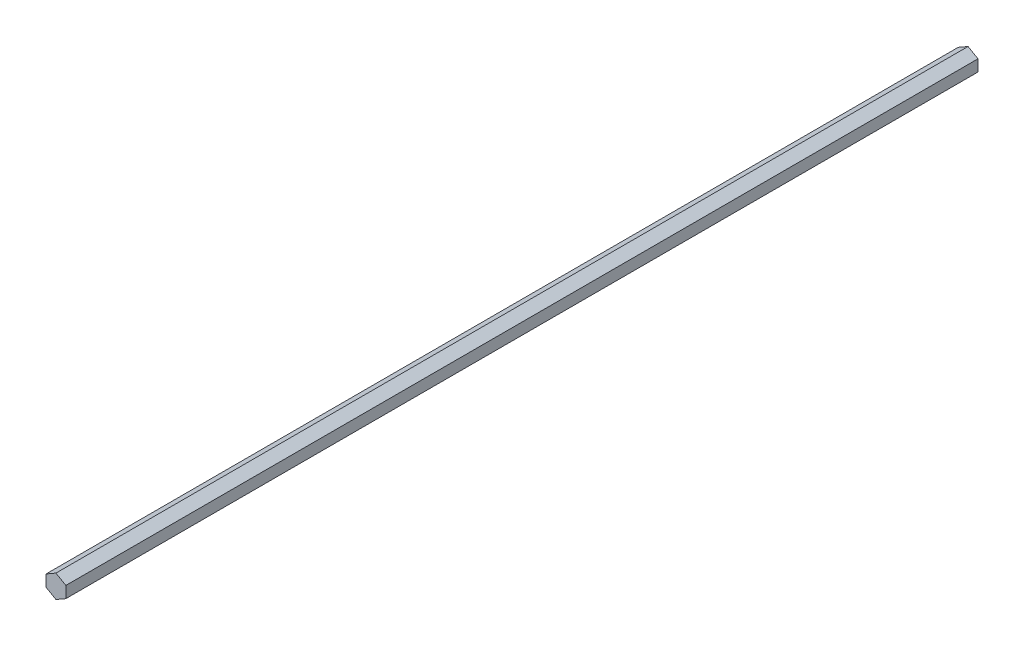
ISO-10303-21;
HEADER;
FILE_DESCRIPTION(('STEP AP214'),'2;1');
FILE_NAME('part.step','',(''),(''),'','','');
FILE_SCHEMA(('AUTOMOTIVE_DESIGN { 1 0 10303 214 1 1 1 1 }'));
ENDSEC;
DATA;
#1=APPLICATION_CONTEXT('core data for automotive mechanical design processes');
#2=APPLICATION_PROTOCOL_DEFINITION('international standard','automotive_design',2000,#1);
#3=PRODUCT_CONTEXT('',#1,'mechanical');
#4=PRODUCT('Part','Part','',(#3));
#5=PRODUCT_RELATED_PRODUCT_CATEGORY('part','',(#4));
#6=PRODUCT_DEFINITION_FORMATION('','',#4);
#7=PRODUCT_DEFINITION_CONTEXT('part definition',#1,'design');
#8=PRODUCT_DEFINITION('design','',#6,#7);
#9=PRODUCT_DEFINITION_SHAPE('','',#8);
#10=(LENGTH_UNIT() NAMED_UNIT(*) SI_UNIT(.MILLI.,.METRE.));
#11=(NAMED_UNIT(*) PLANE_ANGLE_UNIT() SI_UNIT($,.RADIAN.));
#12=(NAMED_UNIT(*) SI_UNIT($,.STERADIAN.) SOLID_ANGLE_UNIT());
#13=UNCERTAINTY_MEASURE_WITH_UNIT(LENGTH_MEASURE(1.E-05),#10,'distance_accuracy_value','');
#14=(GEOMETRIC_REPRESENTATION_CONTEXT(3) GLOBAL_UNCERTAINTY_ASSIGNED_CONTEXT((#13)) GLOBAL_UNIT_ASSIGNED_CONTEXT((#10,
#11,#12)) REPRESENTATION_CONTEXT('',''));
#15=CARTESIAN_POINT('',(0.,0.,0.));
#16=DIRECTION('',(0.,0.,1.));
#17=DIRECTION('',(1.,0.,0.));
#18=AXIS2_PLACEMENT_3D('',#15,#16,#17);
#19=CARTESIAN_POINT('',(6.34999999999995,3.66617420935419,292.1));
#20=DIRECTION('',(-0.499999999999995,-0.866025403784441,0.));
#21=DIRECTION('',(0.866025403784441,-0.499999999999995,0.));
#22=AXIS2_PLACEMENT_3D('',#19,#20,#21);
#23=PLANE('',#22);
#24=DIRECTION('',(-0.866025403784442,0.499999999999995,0.));
#25=VECTOR('',#24,1.);
#26=CARTESIAN_POINT('',(6.34999999999995,3.66617420935419,-292.1));
#27=LINE('',#26,#25);
#28=CARTESIAN_POINT('',(6.34999999999995,3.66617420935419,-292.1));
#29=VERTEX_POINT('',#28);
#30=CARTESIAN_POINT('',(0.,7.33234841870824,-292.1));
#31=VERTEX_POINT('',#30);
#32=EDGE_CURVE('E117',#29,#31,#27,.T.);
#33=ORIENTED_EDGE('',*,*,#32,.T.);
#34=DIRECTION('',(0.,0.,-1.));
#35=VECTOR('',#34,1.);
#36=CARTESIAN_POINT('',(0.,7.33234841870824,292.1));
#37=LINE('',#36,#35);
#38=CARTESIAN_POINT('',(0.,7.33234841870824,292.1));
#39=VERTEX_POINT('',#38);
#40=EDGE_CURVE('E11',#39,#31,#37,.T.);
#41=ORIENTED_EDGE('',*,*,#40,.F.);
#42=DIRECTION('',(-0.866025403784442,0.499999999999995,0.));
#43=VECTOR('',#42,1.);
#44=CARTESIAN_POINT('',(6.34999999999995,3.66617420935419,292.1));
#45=LINE('',#44,#43);
#46=CARTESIAN_POINT('',(6.34999999999995,3.66617420935419,292.1));
#47=VERTEX_POINT('',#46);
#48=EDGE_CURVE('E127',#47,#39,#45,.T.);
#49=ORIENTED_EDGE('',*,*,#48,.F.);
#50=DIRECTION('',(0.,0.,-1.));
#51=VECTOR('',#50,1.);
#52=CARTESIAN_POINT('',(6.34999999999995,3.66617420935419,292.1));
#53=LINE('',#52,#51);
#54=EDGE_CURVE('E113',#47,#29,#53,.T.);
#55=ORIENTED_EDGE('',*,*,#54,.T.);
#56=EDGE_LOOP('',(#33,#41,#49,#55));
#57=FACE_BOUND('',#56,.T.);
#58=ADVANCED_FACE('F33',(#57),#23,.F.);
#59=CARTESIAN_POINT('',(0.,7.33234841870824,292.1));
#60=DIRECTION('',(0.500000000000001,-0.866025403784438,0.));
#61=DIRECTION('',(0.866025403784438,0.500000000000001,0.));
#62=AXIS2_PLACEMENT_3D('',#59,#60,#61);
#63=PLANE('',#62);
#64=DIRECTION('',(-0.866025403784438,-0.500000000000001,0.));
#65=VECTOR('',#64,1.);
#66=CARTESIAN_POINT('',(0.,7.33234841870824,-292.1));
#67=LINE('',#66,#65);
#68=CARTESIAN_POINT('',(-6.35,3.6661742093541,-292.1));
#69=VERTEX_POINT('',#68);
#70=EDGE_CURVE('E120',#31,#69,#67,.T.);
#71=ORIENTED_EDGE('',*,*,#70,.T.);
#72=DIRECTION('',(0.,0.,-1.));
#73=VECTOR('',#72,1.);
#74=CARTESIAN_POINT('',(-6.35,3.6661742093541,292.1));
#75=LINE('',#74,#73);
#76=CARTESIAN_POINT('',(-6.35,3.6661742093541,292.1));
#77=VERTEX_POINT('',#76);
#78=EDGE_CURVE('E41',#77,#69,#75,.T.);
#79=ORIENTED_EDGE('',*,*,#78,.F.);
#80=DIRECTION('',(-0.866025403784438,-0.500000000000001,0.));
#81=VECTOR('',#80,1.);
#82=CARTESIAN_POINT('',(0.,7.33234841870824,292.1));
#83=LINE('',#82,#81);
#84=EDGE_CURVE('E86',#39,#77,#83,.T.);
#85=ORIENTED_EDGE('',*,*,#84,.F.);
#86=ORIENTED_EDGE('',*,*,#40,.T.);
#87=EDGE_LOOP('',(#71,#79,#85,#86));
#88=FACE_BOUND('',#87,.T.);
#89=ADVANCED_FACE('F151',(#88),#63,.F.);
#90=CARTESIAN_POINT('',(-6.35,3.6661742093541,292.1));
#91=DIRECTION('',(1.,0.,0.));
#92=DIRECTION('',(0.,1.,0.));
#93=AXIS2_PLACEMENT_3D('',#90,#91,#92);
#94=PLANE('',#93);
#95=DIRECTION('',(0.,-1.,0.));
#96=VECTOR('',#95,1.);
#97=CARTESIAN_POINT('',(-6.35,3.6661742093541,-292.1));
#98=LINE('',#97,#96);
#99=CARTESIAN_POINT('',(-6.34999999999997,-3.66617420935415,-292.1));
#100=VERTEX_POINT('',#99);
#101=EDGE_CURVE('E122',#69,#100,#98,.T.);
#102=ORIENTED_EDGE('',*,*,#101,.T.);
#103=DIRECTION('',(0.,0.,-1.));
#104=VECTOR('',#103,1.);
#105=CARTESIAN_POINT('',(-6.34999999999997,-3.66617420935415,292.1));
#106=LINE('',#105,#104);
#107=CARTESIAN_POINT('',(-6.34999999999997,-3.66617420935415,292.1));
#108=VERTEX_POINT('',#107);
#109=EDGE_CURVE('E108',#108,#100,#106,.T.);
#110=ORIENTED_EDGE('',*,*,#109,.F.);
#111=DIRECTION('',(0.,-1.,0.));
#112=VECTOR('',#111,1.);
#113=CARTESIAN_POINT('',(-6.35,3.6661742093541,292.1));
#114=LINE('',#113,#112);
#115=EDGE_CURVE('E99',#77,#108,#114,.T.);
#116=ORIENTED_EDGE('',*,*,#115,.F.);
#117=ORIENTED_EDGE('',*,*,#78,.T.);
#118=EDGE_LOOP('',(#102,#110,#116,#117));
#119=FACE_BOUND('',#118,.T.);
#120=ADVANCED_FACE('F133',(#119),#94,.F.);
#121=CARTESIAN_POINT('',(-6.34999999999997,-3.66617420935415,292.1));
#122=DIRECTION('',(0.499999999999995,0.866025403784442,0.));
#123=DIRECTION('',(-0.866025403784442,0.499999999999995,0.));
#124=AXIS2_PLACEMENT_3D('',#121,#122,#123);
#125=PLANE('',#124);
#126=DIRECTION('',(0.866025403784442,-0.499999999999995,0.));
#127=VECTOR('',#126,1.);
#128=CARTESIAN_POINT('',(-6.34999999999997,-3.66617420935415,-292.1));
#129=LINE('',#128,#127);
#130=CARTESIAN_POINT('',(0.,-7.33234841870823,-292.1));
#131=VERTEX_POINT('',#130);
#132=EDGE_CURVE('E107',#100,#131,#129,.T.);
#133=ORIENTED_EDGE('',*,*,#132,.T.);
#134=DIRECTION('',(0.,0.,-1.));
#135=VECTOR('',#134,1.);
#136=CARTESIAN_POINT('',(0.,-7.33234841870823,292.1));
#137=LINE('',#136,#135);
#138=CARTESIAN_POINT('',(0.,-7.33234841870823,292.1));
#139=VERTEX_POINT('',#138);
#140=EDGE_CURVE('E104',#139,#131,#137,.T.);
#141=ORIENTED_EDGE('',*,*,#140,.F.);
#142=DIRECTION('',(0.866025403784442,-0.499999999999995,0.));
#143=VECTOR('',#142,1.);
#144=CARTESIAN_POINT('',(-6.34999999999997,-3.66617420935415,292.1));
#145=LINE('',#144,#143);
#146=EDGE_CURVE('E93',#108,#139,#145,.T.);
#147=ORIENTED_EDGE('',*,*,#146,.F.);
#148=ORIENTED_EDGE('',*,*,#109,.T.);
#149=EDGE_LOOP('',(#133,#141,#147,#148));
#150=FACE_BOUND('',#149,.T.);
#151=ADVANCED_FACE('F105',(#150),#125,.F.);
#152=CARTESIAN_POINT('',(0.,-7.33234841870823,292.1));
#153=DIRECTION('',(-0.500000000000007,0.866025403784435,0.));
#154=DIRECTION('',(-0.866025403784435,-0.500000000000007,0.));
#155=AXIS2_PLACEMENT_3D('',#152,#153,#154);
#156=PLANE('',#155);
#157=DIRECTION('',(0.866025403784434,0.500000000000007,0.));
#158=VECTOR('',#157,1.);
#159=CARTESIAN_POINT('',(0.,-7.33234841870823,-292.1));
#160=LINE('',#159,#158);
#161=CARTESIAN_POINT('',(6.35000000000002,-3.66617420935406,-292.1));
#162=VERTEX_POINT('',#161);
#163=EDGE_CURVE('E72',#131,#162,#160,.T.);
#164=ORIENTED_EDGE('',*,*,#163,.T.);
#165=DIRECTION('',(0.,0.,-1.));
#166=VECTOR('',#165,1.);
#167=CARTESIAN_POINT('',(6.35000000000002,-3.66617420935406,292.1));
#168=LINE('',#167,#166);
#169=CARTESIAN_POINT('',(6.35000000000002,-3.66617420935406,292.1));
#170=VERTEX_POINT('',#169);
#171=EDGE_CURVE('E109',#170,#162,#168,.T.);
#172=ORIENTED_EDGE('',*,*,#171,.F.);
#173=DIRECTION('',(0.866025403784434,0.500000000000007,0.));
#174=VECTOR('',#173,1.);
#175=CARTESIAN_POINT('',(0.,-7.33234841870823,292.1));
#176=LINE('',#175,#174);
#177=EDGE_CURVE('E97',#139,#170,#176,.T.);
#178=ORIENTED_EDGE('',*,*,#177,.F.);
#179=ORIENTED_EDGE('',*,*,#140,.T.);
#180=EDGE_LOOP('',(#164,#172,#178,#179));
#181=FACE_BOUND('',#180,.T.);
#182=ADVANCED_FACE('F111',(#181),#156,.F.);
#183=CARTESIAN_POINT('',(6.35000000000002,-3.66617420935406,292.1));
#184=DIRECTION('',(-1.,0.,0.));
#185=DIRECTION('',(0.,-1.,0.));
#186=AXIS2_PLACEMENT_3D('',#183,#184,#185);
#187=PLANE('',#186);
#188=DIRECTION('',(0.,1.,0.));
#189=VECTOR('',#188,1.);
#190=CARTESIAN_POINT('',(6.35000000000002,-3.66617420935406,-292.1));
#191=LINE('',#190,#189);
#192=EDGE_CURVE('E78',#162,#29,#191,.T.);
#193=ORIENTED_EDGE('',*,*,#192,.T.);
#194=ORIENTED_EDGE('',*,*,#54,.F.);
#195=DIRECTION('',(0.,1.,0.));
#196=VECTOR('',#195,1.);
#197=CARTESIAN_POINT('',(6.35000000000002,-3.66617420935406,292.1));
#198=LINE('',#197,#196);
#199=EDGE_CURVE('E49',#170,#47,#198,.T.);
#200=ORIENTED_EDGE('',*,*,#199,.F.);
#201=ORIENTED_EDGE('',*,*,#171,.T.);
#202=EDGE_LOOP('',(#193,#194,#200,#201));
#203=FACE_BOUND('',#202,.T.);
#204=ADVANCED_FACE('F140',(#203),#187,.F.);
#205=CARTESIAN_POINT('',(0.,0.,292.1));
#206=DIRECTION('',(0.,0.,1.));
#207=DIRECTION('',(1.,0.,0.));
#208=AXIS2_PLACEMENT_3D('',#205,#206,#207);
#209=PLANE('',#208);
#210=ORIENTED_EDGE('',*,*,#48,.T.);
#211=ORIENTED_EDGE('',*,*,#84,.T.);
#212=ORIENTED_EDGE('',*,*,#115,.T.);
#213=ORIENTED_EDGE('',*,*,#146,.T.);
#214=ORIENTED_EDGE('',*,*,#177,.T.);
#215=ORIENTED_EDGE('',*,*,#199,.T.);
#216=EDGE_LOOP('',(#210,#211,#212,#213,#214,#215));
#217=FACE_BOUND('',#216,.T.);
#218=ADVANCED_FACE('F95',(#217),#209,.T.);
#219=CARTESIAN_POINT('',(0.,0.,-292.1));
#220=DIRECTION('',(0.,0.,1.));
#221=DIRECTION('',(1.,0.,0.));
#222=AXIS2_PLACEMENT_3D('',#219,#220,#221);
#223=PLANE('',#222);
#224=ORIENTED_EDGE('',*,*,#32,.F.);
#225=ORIENTED_EDGE('',*,*,#192,.F.);
#226=ORIENTED_EDGE('',*,*,#163,.F.);
#227=ORIENTED_EDGE('',*,*,#132,.F.);
#228=ORIENTED_EDGE('',*,*,#101,.F.);
#229=ORIENTED_EDGE('',*,*,#70,.F.);
#230=EDGE_LOOP('',(#224,#225,#226,#227,#228,#229));
#231=FACE_BOUND('',#230,.T.);
#232=ADVANCED_FACE('F136',(#231),#223,.F.);
#233=CLOSED_SHELL('',(#58,#89,#120,#151,#182,#204,#218,#232));
#234=MANIFOLD_SOLID_BREP('B2',#233);
#235=ADVANCED_BREP_SHAPE_REPRESENTATION('',(#18,#234),#14);
#236=SHAPE_DEFINITION_REPRESENTATION(#9,#235);
ENDSEC;
END-ISO-10303-21;
